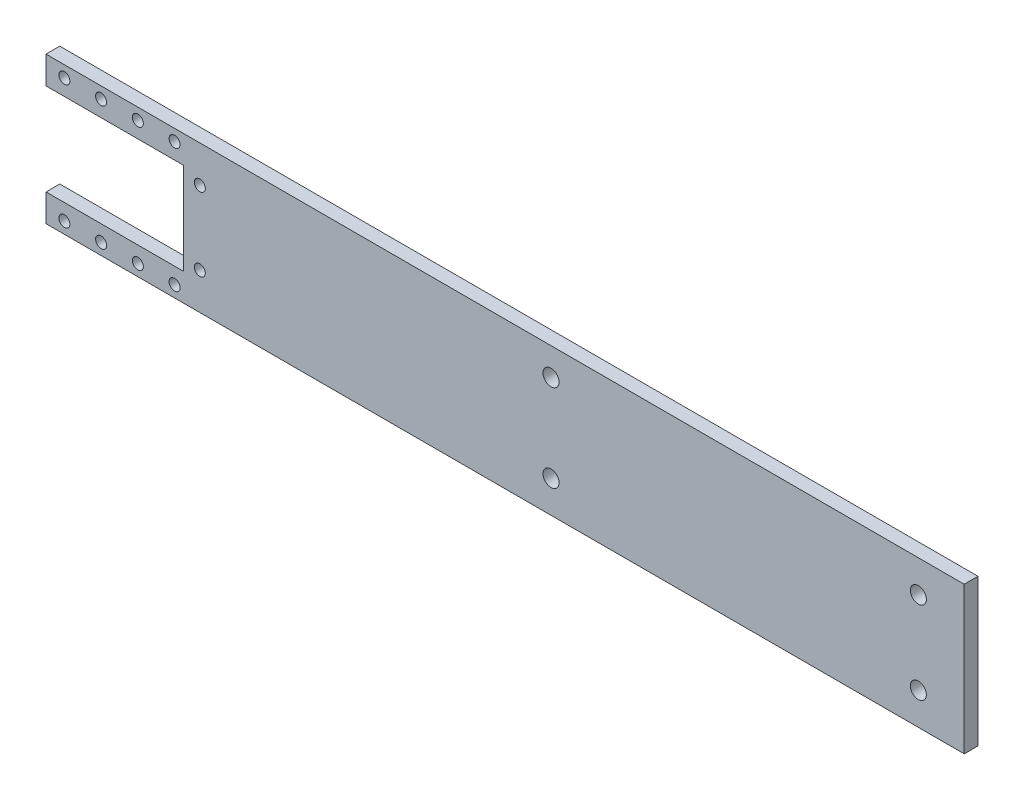
ISO-10303-21;
HEADER;
FILE_DESCRIPTION(('STEP AP214'),'2;1');
FILE_NAME('part.step','',(''),(''),'','','');
FILE_SCHEMA(('AUTOMOTIVE_DESIGN { 1 0 10303 214 1 1 1 1 }'));
ENDSEC;
DATA;
#1=APPLICATION_CONTEXT('core data for automotive mechanical design processes');
#2=APPLICATION_PROTOCOL_DEFINITION('international standard','automotive_design',2000,#1);
#3=PRODUCT_CONTEXT('',#1,'mechanical');
#4=PRODUCT('Part','Part','',(#3));
#5=PRODUCT_RELATED_PRODUCT_CATEGORY('part','',(#4));
#6=PRODUCT_DEFINITION_FORMATION('','',#4);
#7=PRODUCT_DEFINITION_CONTEXT('part definition',#1,'design');
#8=PRODUCT_DEFINITION('design','',#6,#7);
#9=PRODUCT_DEFINITION_SHAPE('','',#8);
#10=(LENGTH_UNIT() NAMED_UNIT(*) SI_UNIT(.MILLI.,.METRE.));
#11=(NAMED_UNIT(*) PLANE_ANGLE_UNIT() SI_UNIT($,.RADIAN.));
#12=(NAMED_UNIT(*) SI_UNIT($,.STERADIAN.) SOLID_ANGLE_UNIT());
#13=UNCERTAINTY_MEASURE_WITH_UNIT(LENGTH_MEASURE(1.E-05),#10,'distance_accuracy_value','');
#14=(GEOMETRIC_REPRESENTATION_CONTEXT(3) GLOBAL_UNCERTAINTY_ASSIGNED_CONTEXT((#13)) GLOBAL_UNIT_ASSIGNED_CONTEXT((#10,
#11,#12)) REPRESENTATION_CONTEXT('',''));
#15=CARTESIAN_POINT('',(0.,0.,0.));
#16=DIRECTION('',(0.,0.,1.));
#17=DIRECTION('',(1.,0.,0.));
#18=AXIS2_PLACEMENT_3D('',#15,#16,#17);
#19=CARTESIAN_POINT('',(-17.75,10.,3.));
#20=DIRECTION('',(-1.,0.,0.));
#21=DIRECTION('',(0.,-1.,0.));
#22=AXIS2_PLACEMENT_3D('',#19,#20,#21);
#23=PLANE('',#22);
#24=DIRECTION('',(0.,1.,0.));
#25=VECTOR('',#24,1.);
#26=CARTESIAN_POINT('',(-17.75,10.,0.));
#27=LINE('',#26,#25);
#28=CARTESIAN_POINT('',(-17.75,10.,0.));
#29=VERTEX_POINT('',#28);
#30=CARTESIAN_POINT('',(-17.75,16.,0.));
#31=VERTEX_POINT('',#30);
#32=EDGE_CURVE('E136',#29,#31,#27,.T.);
#33=ORIENTED_EDGE('',*,*,#32,.F.);
#34=DIRECTION('',(0.,0.,-1.));
#35=VECTOR('',#34,1.);
#36=CARTESIAN_POINT('',(-17.75,10.,3.));
#37=LINE('',#36,#35);
#38=CARTESIAN_POINT('',(-17.75,10.,3.));
#39=VERTEX_POINT('',#38);
#40=EDGE_CURVE('E11',#39,#29,#37,.T.);
#41=ORIENTED_EDGE('',*,*,#40,.F.);
#42=DIRECTION('',(0.,1.,0.));
#43=VECTOR('',#42,1.);
#44=CARTESIAN_POINT('',(-17.75,10.,3.));
#45=LINE('',#44,#43);
#46=CARTESIAN_POINT('',(-17.75,16.,3.));
#47=VERTEX_POINT('',#46);
#48=EDGE_CURVE('E155',#39,#47,#45,.T.);
#49=ORIENTED_EDGE('',*,*,#48,.T.);
#50=DIRECTION('',(0.,0.,-1.));
#51=VECTOR('',#50,1.);
#52=CARTESIAN_POINT('',(-17.75,16.,3.));
#53=LINE('',#52,#51);
#54=EDGE_CURVE('E40',#47,#31,#53,.T.);
#55=ORIENTED_EDGE('',*,*,#54,.T.);
#56=EDGE_LOOP('',(#33,#41,#49,#55));
#57=FACE_BOUND('',#56,.T.);
#58=ADVANCED_FACE('F37',(#57),#23,.T.);
#59=CARTESIAN_POINT('',(-17.75,10.,3.));
#60=DIRECTION('',(0.,1.,0.));
#61=DIRECTION('',(-1.,0.,0.));
#62=AXIS2_PLACEMENT_3D('',#59,#60,#61);
#63=PLANE('',#62);
#64=DIRECTION('',(1.,0.,0.));
#65=VECTOR('',#64,1.);
#66=CARTESIAN_POINT('',(-17.75,10.,0.));
#67=LINE('',#66,#65);
#68=CARTESIAN_POINT('',(12.25,10.,0.));
#69=VERTEX_POINT('',#68);
#70=EDGE_CURVE('E82',#29,#69,#67,.T.);
#71=ORIENTED_EDGE('',*,*,#70,.T.);
#72=DIRECTION('',(0.,0.,-1.));
#73=VECTOR('',#72,1.);
#74=CARTESIAN_POINT('',(12.25,10.,3.));
#75=LINE('',#74,#73);
#76=CARTESIAN_POINT('',(12.25,10.,3.));
#77=VERTEX_POINT('',#76);
#78=EDGE_CURVE('E46',#77,#69,#75,.T.);
#79=ORIENTED_EDGE('',*,*,#78,.F.);
#80=DIRECTION('',(1.,0.,0.));
#81=VECTOR('',#80,1.);
#82=CARTESIAN_POINT('',(-17.75,10.,3.));
#83=LINE('',#82,#81);
#84=EDGE_CURVE('E115',#39,#77,#83,.T.);
#85=ORIENTED_EDGE('',*,*,#84,.F.);
#86=ORIENTED_EDGE('',*,*,#40,.T.);
#87=EDGE_LOOP('',(#71,#79,#85,#86));
#88=FACE_BOUND('',#87,.T.);
#89=ADVANCED_FACE('F314',(#88),#63,.F.);
#90=CARTESIAN_POINT('',(12.25,10.,3.));
#91=DIRECTION('',(1.,0.,0.));
#92=DIRECTION('',(0.,0.,-1.));
#93=AXIS2_PLACEMENT_3D('',#90,#91,#92);
#94=PLANE('',#93);
#95=DIRECTION('',(0.,-1.,0.));
#96=VECTOR('',#95,1.);
#97=CARTESIAN_POINT('',(12.25,10.,0.));
#98=LINE('',#97,#96);
#99=CARTESIAN_POINT('',(12.25,-10.,0.));
#100=VERTEX_POINT('',#99);
#101=EDGE_CURVE('E122',#69,#100,#98,.T.);
#102=ORIENTED_EDGE('',*,*,#101,.T.);
#103=DIRECTION('',(0.,0.,-1.));
#104=VECTOR('',#103,1.);
#105=CARTESIAN_POINT('',(12.25,-10.,3.));
#106=LINE('',#105,#104);
#107=CARTESIAN_POINT('',(12.25,-10.,3.));
#108=VERTEX_POINT('',#107);
#109=EDGE_CURVE('E119',#108,#100,#106,.T.);
#110=ORIENTED_EDGE('',*,*,#109,.F.);
#111=DIRECTION('',(0.,-1.,0.));
#112=VECTOR('',#111,1.);
#113=CARTESIAN_POINT('',(12.25,10.,3.));
#114=LINE('',#113,#112);
#115=EDGE_CURVE('E107',#77,#108,#114,.T.);
#116=ORIENTED_EDGE('',*,*,#115,.F.);
#117=ORIENTED_EDGE('',*,*,#78,.T.);
#118=EDGE_LOOP('',(#102,#110,#116,#117));
#119=FACE_BOUND('',#118,.T.);
#120=ADVANCED_FACE('F120',(#119),#94,.F.);
#121=CARTESIAN_POINT('',(-17.75,-10.,3.));
#122=DIRECTION('',(0.,1.,0.));
#123=DIRECTION('',(0.,0.,1.));
#124=AXIS2_PLACEMENT_3D('',#121,#122,#123);
#125=PLANE('',#124);
#126=DIRECTION('',(1.,0.,0.));
#127=VECTOR('',#126,1.);
#128=CARTESIAN_POINT('',(-17.75,-10.,0.));
#129=LINE('',#128,#127);
#130=CARTESIAN_POINT('',(-17.75,-10.,0.));
#131=VERTEX_POINT('',#130);
#132=EDGE_CURVE('E152',#131,#100,#129,.T.);
#133=ORIENTED_EDGE('',*,*,#132,.F.);
#134=DIRECTION('',(0.,0.,-1.));
#135=VECTOR('',#134,1.);
#136=CARTESIAN_POINT('',(-17.75,-10.,3.));
#137=LINE('',#136,#135);
#138=CARTESIAN_POINT('',(-17.75,-10.,3.));
#139=VERTEX_POINT('',#138);
#140=EDGE_CURVE('E126',#139,#131,#137,.T.);
#141=ORIENTED_EDGE('',*,*,#140,.F.);
#142=DIRECTION('',(1.,0.,0.));
#143=VECTOR('',#142,1.);
#144=CARTESIAN_POINT('',(-17.75,-10.,3.));
#145=LINE('',#144,#143);
#146=EDGE_CURVE('E113',#139,#108,#145,.T.);
#147=ORIENTED_EDGE('',*,*,#146,.T.);
#148=ORIENTED_EDGE('',*,*,#109,.T.);
#149=EDGE_LOOP('',(#133,#141,#147,#148));
#150=FACE_BOUND('',#149,.T.);
#151=ADVANCED_FACE('F128',(#150),#125,.T.);
#152=CARTESIAN_POINT('',(-17.75,-16.,3.));
#153=DIRECTION('',(-1.,0.,0.));
#154=DIRECTION('',(0.,0.,1.));
#155=AXIS2_PLACEMENT_3D('',#152,#153,#154);
#156=PLANE('',#155);
#157=DIRECTION('',(0.,1.,0.));
#158=VECTOR('',#157,1.);
#159=CARTESIAN_POINT('',(-17.75,-16.,0.));
#160=LINE('',#159,#158);
#161=CARTESIAN_POINT('',(-17.75,-16.,0.));
#162=VERTEX_POINT('',#161);
#163=EDGE_CURVE('E149',#162,#131,#160,.T.);
#164=ORIENTED_EDGE('',*,*,#163,.F.);
#165=DIRECTION('',(0.,0.,-1.));
#166=VECTOR('',#165,1.);
#167=CARTESIAN_POINT('',(-17.75,-16.,3.));
#168=LINE('',#167,#166);
#169=CARTESIAN_POINT('',(-17.75,-16.,3.));
#170=VERTEX_POINT('',#169);
#171=EDGE_CURVE('E159',#170,#162,#168,.T.);
#172=ORIENTED_EDGE('',*,*,#171,.F.);
#173=DIRECTION('',(0.,1.,0.));
#174=VECTOR('',#173,1.);
#175=CARTESIAN_POINT('',(-17.75,-16.,3.));
#176=LINE('',#175,#174);
#177=EDGE_CURVE('E129',#170,#139,#176,.T.);
#178=ORIENTED_EDGE('',*,*,#177,.T.);
#179=ORIENTED_EDGE('',*,*,#140,.T.);
#180=EDGE_LOOP('',(#164,#172,#178,#179));
#181=FACE_BOUND('',#180,.T.);
#182=ADVANCED_FACE('F170',(#181),#156,.T.);
#183=CARTESIAN_POINT('',(182.25,-16.,3.));
#184=DIRECTION('',(0.,-1.,0.));
#185=DIRECTION('',(1.,0.,0.));
#186=AXIS2_PLACEMENT_3D('',#183,#184,#185);
#187=PLANE('',#186);
#188=DIRECTION('',(-1.,0.,0.));
#189=VECTOR('',#188,1.);
#190=CARTESIAN_POINT('',(182.25,-16.,0.));
#191=LINE('',#190,#189);
#192=CARTESIAN_POINT('',(182.25,-16.,0.));
#193=VERTEX_POINT('',#192);
#194=EDGE_CURVE('E146',#193,#162,#191,.T.);
#195=ORIENTED_EDGE('',*,*,#194,.F.);
#196=DIRECTION('',(0.,0.,-1.));
#197=VECTOR('',#196,1.);
#198=CARTESIAN_POINT('',(182.25,-16.,3.));
#199=LINE('',#198,#197);
#200=CARTESIAN_POINT('',(182.25,-16.,3.));
#201=VERTEX_POINT('',#200);
#202=EDGE_CURVE('E161',#201,#193,#199,.T.);
#203=ORIENTED_EDGE('',*,*,#202,.F.);
#204=DIRECTION('',(-1.,0.,0.));
#205=VECTOR('',#204,1.);
#206=CARTESIAN_POINT('',(182.25,-16.,3.));
#207=LINE('',#206,#205);
#208=EDGE_CURVE('E131',#201,#170,#207,.T.);
#209=ORIENTED_EDGE('',*,*,#208,.T.);
#210=ORIENTED_EDGE('',*,*,#171,.T.);
#211=EDGE_LOOP('',(#195,#203,#209,#210));
#212=FACE_BOUND('',#211,.T.);
#213=ADVANCED_FACE('F176',(#212),#187,.T.);
#214=CARTESIAN_POINT('',(182.25,16.,3.));
#215=DIRECTION('',(1.,0.,0.));
#216=DIRECTION('',(0.,0.,-1.));
#217=AXIS2_PLACEMENT_3D('',#214,#215,#216);
#218=PLANE('',#217);
#219=DIRECTION('',(0.,-1.,0.));
#220=VECTOR('',#219,1.);
#221=CARTESIAN_POINT('',(182.25,16.,0.));
#222=LINE('',#221,#220);
#223=CARTESIAN_POINT('',(182.25,16.,0.));
#224=VERTEX_POINT('',#223);
#225=EDGE_CURVE('E143',#224,#193,#222,.T.);
#226=ORIENTED_EDGE('',*,*,#225,.F.);
#227=DIRECTION('',(0.,0.,-1.));
#228=VECTOR('',#227,1.);
#229=CARTESIAN_POINT('',(182.25,16.,3.));
#230=LINE('',#229,#228);
#231=CARTESIAN_POINT('',(182.25,16.,3.));
#232=VERTEX_POINT('',#231);
#233=EDGE_CURVE('E162',#232,#224,#230,.T.);
#234=ORIENTED_EDGE('',*,*,#233,.F.);
#235=DIRECTION('',(0.,-1.,0.));
#236=VECTOR('',#235,1.);
#237=CARTESIAN_POINT('',(182.25,16.,3.));
#238=LINE('',#237,#236);
#239=EDGE_CURVE('E177',#232,#201,#238,.T.);
#240=ORIENTED_EDGE('',*,*,#239,.T.);
#241=ORIENTED_EDGE('',*,*,#202,.T.);
#242=EDGE_LOOP('',(#226,#234,#240,#241));
#243=FACE_BOUND('',#242,.T.);
#244=ADVANCED_FACE('F330',(#243),#218,.T.);
#245=CARTESIAN_POINT('',(-17.75,16.,3.));
#246=DIRECTION('',(0.,1.,0.));
#247=DIRECTION('',(0.,0.,1.));
#248=AXIS2_PLACEMENT_3D('',#245,#246,#247);
#249=PLANE('',#248);
#250=DIRECTION('',(1.,0.,0.));
#251=VECTOR('',#250,1.);
#252=CARTESIAN_POINT('',(-17.75,16.,0.));
#253=LINE('',#252,#251);
#254=EDGE_CURVE('E139',#31,#224,#253,.T.);
#255=ORIENTED_EDGE('',*,*,#254,.F.);
#256=ORIENTED_EDGE('',*,*,#54,.F.);
#257=DIRECTION('',(1.,0.,0.));
#258=VECTOR('',#257,1.);
#259=CARTESIAN_POINT('',(-17.75,16.,3.));
#260=LINE('',#259,#258);
#261=EDGE_CURVE('E178',#47,#232,#260,.T.);
#262=ORIENTED_EDGE('',*,*,#261,.T.);
#263=ORIENTED_EDGE('',*,*,#233,.T.);
#264=EDGE_LOOP('',(#255,#256,#262,#263));
#265=FACE_BOUND('',#264,.T.);
#266=ADVANCED_FACE('F164',(#265),#249,.T.);
#267=CARTESIAN_POINT('',(0.,0.,3.));
#268=DIRECTION('',(0.,0.,-1.));
#269=DIRECTION('',(-1.,0.,0.));
#270=AXIS2_PLACEMENT_3D('',#267,#268,#269);
#271=PLANE('',#270);
#272=CARTESIAN_POINT('',(92.25,-8.99999999999998,3.));
#273=DIRECTION('',(0.,0.,1.));
#274=DIRECTION('',(1.,0.,0.));
#275=AXIS2_PLACEMENT_3D('',#272,#273,#274);
#276=CIRCLE('',#275,1.75);
#277=CARTESIAN_POINT('',(94.,-8.99999999999998,3.));
#278=VERTEX_POINT('',#277);
#279=EDGE_CURVE('E263',#278,#278,#276,.T.);
#280=ORIENTED_EDGE('',*,*,#279,.F.);
#281=EDGE_LOOP('',(#280));
#282=FACE_BOUND('',#281,.T.);
#283=CARTESIAN_POINT('',(92.25,10.,3.));
#284=DIRECTION('',(0.,0.,1.));
#285=DIRECTION('',(1.,0.,0.));
#286=AXIS2_PLACEMENT_3D('',#283,#284,#285);
#287=CIRCLE('',#286,1.75);
#288=CARTESIAN_POINT('',(94.,10.,3.));
#289=VERTEX_POINT('',#288);
#290=EDGE_CURVE('E257',#289,#289,#287,.T.);
#291=ORIENTED_EDGE('',*,*,#290,.F.);
#292=EDGE_LOOP('',(#291));
#293=FACE_BOUND('',#292,.T.);
#294=CARTESIAN_POINT('',(172.25,9.,3.));
#295=DIRECTION('',(0.,0.,1.));
#296=DIRECTION('',(1.,0.,0.));
#297=AXIS2_PLACEMENT_3D('',#294,#295,#296);
#298=CIRCLE('',#297,1.75);
#299=CARTESIAN_POINT('',(174.,9.,3.));
#300=VERTEX_POINT('',#299);
#301=EDGE_CURVE('E251',#300,#300,#298,.T.);
#302=ORIENTED_EDGE('',*,*,#301,.F.);
#303=EDGE_LOOP('',(#302));
#304=FACE_BOUND('',#303,.T.);
#305=CARTESIAN_POINT('',(172.25,-8.99999999999998,3.));
#306=DIRECTION('',(0.,0.,1.));
#307=DIRECTION('',(1.,0.,0.));
#308=AXIS2_PLACEMENT_3D('',#305,#306,#307);
#309=CIRCLE('',#308,1.75);
#310=CARTESIAN_POINT('',(174.,-8.99999999999998,3.));
#311=VERTEX_POINT('',#310);
#312=EDGE_CURVE('E245',#311,#311,#309,.T.);
#313=ORIENTED_EDGE('',*,*,#312,.F.);
#314=EDGE_LOOP('',(#313));
#315=FACE_BOUND('',#314,.T.);
#316=CARTESIAN_POINT('',(-13.75,13.5,3.));
#317=DIRECTION('',(0.,0.,1.));
#318=DIRECTION('',(1.,0.,0.));
#319=AXIS2_PLACEMENT_3D('',#316,#317,#318);
#320=CIRCLE('',#319,1.19999999999999);
#321=CARTESIAN_POINT('',(-12.55,13.5,3.));
#322=VERTEX_POINT('',#321);
#323=EDGE_CURVE('E239',#322,#322,#320,.T.);
#324=ORIENTED_EDGE('',*,*,#323,.F.);
#325=EDGE_LOOP('',(#324));
#326=FACE_BOUND('',#325,.T.);
#327=CARTESIAN_POINT('',(-5.75000000000001,13.5,3.));
#328=DIRECTION('',(0.,0.,1.));
#329=DIRECTION('',(1.,0.,0.));
#330=AXIS2_PLACEMENT_3D('',#327,#328,#329);
#331=CIRCLE('',#330,1.19999999999999);
#332=CARTESIAN_POINT('',(-4.55000000000002,13.5,3.));
#333=VERTEX_POINT('',#332);
#334=EDGE_CURVE('E233',#333,#333,#331,.T.);
#335=ORIENTED_EDGE('',*,*,#334,.F.);
#336=EDGE_LOOP('',(#335));
#337=FACE_BOUND('',#336,.T.);
#338=CARTESIAN_POINT('',(2.25,13.5,3.));
#339=DIRECTION('',(0.,0.,1.));
#340=DIRECTION('',(1.,0.,0.));
#341=AXIS2_PLACEMENT_3D('',#338,#339,#340);
#342=CIRCLE('',#341,1.19999999999999);
#343=CARTESIAN_POINT('',(3.44999999999999,13.5,3.));
#344=VERTEX_POINT('',#343);
#345=EDGE_CURVE('E227',#344,#344,#342,.T.);
#346=ORIENTED_EDGE('',*,*,#345,.F.);
#347=EDGE_LOOP('',(#346));
#348=FACE_BOUND('',#347,.T.);
#349=CARTESIAN_POINT('',(10.25,13.5,3.));
#350=DIRECTION('',(0.,0.,1.));
#351=DIRECTION('',(1.,0.,0.));
#352=AXIS2_PLACEMENT_3D('',#349,#350,#351);
#353=CIRCLE('',#352,1.19999999999999);
#354=CARTESIAN_POINT('',(11.45,13.5,3.));
#355=VERTEX_POINT('',#354);
#356=EDGE_CURVE('E221',#355,#355,#353,.T.);
#357=ORIENTED_EDGE('',*,*,#356,.F.);
#358=EDGE_LOOP('',(#357));
#359=FACE_BOUND('',#358,.T.);
#360=CARTESIAN_POINT('',(15.75,8.,3.));
#361=DIRECTION('',(0.,0.,1.));
#362=DIRECTION('',(1.,0.,0.));
#363=AXIS2_PLACEMENT_3D('',#360,#361,#362);
#364=CIRCLE('',#363,1.19999999999999);
#365=CARTESIAN_POINT('',(16.95,8.,3.));
#366=VERTEX_POINT('',#365);
#367=EDGE_CURVE('E215',#366,#366,#364,.T.);
#368=ORIENTED_EDGE('',*,*,#367,.F.);
#369=EDGE_LOOP('',(#368));
#370=FACE_BOUND('',#369,.T.);
#371=CARTESIAN_POINT('',(15.75,-8.,3.));
#372=DIRECTION('',(0.,0.,1.));
#373=DIRECTION('',(1.,0.,0.));
#374=AXIS2_PLACEMENT_3D('',#371,#372,#373);
#375=CIRCLE('',#374,1.19999999999999);
#376=CARTESIAN_POINT('',(16.95,-8.,3.));
#377=VERTEX_POINT('',#376);
#378=EDGE_CURVE('E209',#377,#377,#375,.T.);
#379=ORIENTED_EDGE('',*,*,#378,.F.);
#380=EDGE_LOOP('',(#379));
#381=FACE_BOUND('',#380,.T.);
#382=CARTESIAN_POINT('',(10.25,-13.5,3.));
#383=DIRECTION('',(0.,0.,1.));
#384=DIRECTION('',(1.,0.,0.));
#385=AXIS2_PLACEMENT_3D('',#382,#383,#384);
#386=CIRCLE('',#385,1.19999999999999);
#387=CARTESIAN_POINT('',(11.45,-13.5,3.));
#388=VERTEX_POINT('',#387);
#389=EDGE_CURVE('E203',#388,#388,#386,.T.);
#390=ORIENTED_EDGE('',*,*,#389,.F.);
#391=EDGE_LOOP('',(#390));
#392=FACE_BOUND('',#391,.T.);
#393=CARTESIAN_POINT('',(2.25,-13.5,3.));
#394=DIRECTION('',(0.,0.,1.));
#395=DIRECTION('',(1.,0.,0.));
#396=AXIS2_PLACEMENT_3D('',#393,#394,#395);
#397=CIRCLE('',#396,1.19999999999999);
#398=CARTESIAN_POINT('',(3.44999999999999,-13.5,3.));
#399=VERTEX_POINT('',#398);
#400=EDGE_CURVE('E197',#399,#399,#397,.T.);
#401=ORIENTED_EDGE('',*,*,#400,.F.);
#402=EDGE_LOOP('',(#401));
#403=FACE_BOUND('',#402,.T.);
#404=CARTESIAN_POINT('',(-5.75000000000001,-13.5,3.));
#405=DIRECTION('',(0.,0.,1.));
#406=DIRECTION('',(1.,0.,0.));
#407=AXIS2_PLACEMENT_3D('',#404,#405,#406);
#408=CIRCLE('',#407,1.19999999999999);
#409=CARTESIAN_POINT('',(-4.55000000000002,-13.5,3.));
#410=VERTEX_POINT('',#409);
#411=EDGE_CURVE('E191',#410,#410,#408,.T.);
#412=ORIENTED_EDGE('',*,*,#411,.F.);
#413=EDGE_LOOP('',(#412));
#414=FACE_BOUND('',#413,.T.);
#415=CARTESIAN_POINT('',(-13.75,-13.5,3.));
#416=DIRECTION('',(0.,0.,1.));
#417=DIRECTION('',(1.,0.,0.));
#418=AXIS2_PLACEMENT_3D('',#415,#416,#417);
#419=CIRCLE('',#418,1.19999999999999);
#420=CARTESIAN_POINT('',(-12.55,-13.5,3.));
#421=VERTEX_POINT('',#420);
#422=EDGE_CURVE('E185',#421,#421,#419,.T.);
#423=ORIENTED_EDGE('',*,*,#422,.F.);
#424=EDGE_LOOP('',(#423));
#425=FACE_BOUND('',#424,.T.);
#426=ORIENTED_EDGE('',*,*,#48,.F.);
#427=ORIENTED_EDGE('',*,*,#84,.T.);
#428=ORIENTED_EDGE('',*,*,#115,.T.);
#429=ORIENTED_EDGE('',*,*,#146,.F.);
#430=ORIENTED_EDGE('',*,*,#177,.F.);
#431=ORIENTED_EDGE('',*,*,#208,.F.);
#432=ORIENTED_EDGE('',*,*,#239,.F.);
#433=ORIENTED_EDGE('',*,*,#261,.F.);
#434=EDGE_LOOP('',(#426,#427,#428,#429,#430,#431,#432,#433));
#435=FACE_BOUND('',#434,.T.);
#436=ADVANCED_FACE('F110',(#282,#293,#304,#315,#326,#337,#348,#359,#370,#381,#392,#403,#414,
#425,#435),#271,.F.);
#437=CARTESIAN_POINT('',(0.,0.,0.));
#438=DIRECTION('',(0.,0.,-1.));
#439=DIRECTION('',(-1.,0.,0.));
#440=AXIS2_PLACEMENT_3D('',#437,#438,#439);
#441=PLANE('',#440);
#442=CARTESIAN_POINT('',(92.25,-8.99999999999998,0.));
#443=DIRECTION('',(0.,0.,1.));
#444=DIRECTION('',(1.,0.,0.));
#445=AXIS2_PLACEMENT_3D('',#442,#443,#444);
#446=CIRCLE('',#445,1.75);
#447=CARTESIAN_POINT('',(94.,-8.99999999999998,0.));
#448=VERTEX_POINT('',#447);
#449=EDGE_CURVE('E260',#448,#448,#446,.T.);
#450=ORIENTED_EDGE('',*,*,#449,.T.);
#451=EDGE_LOOP('',(#450));
#452=FACE_BOUND('',#451,.T.);
#453=CARTESIAN_POINT('',(92.25,10.,0.));
#454=DIRECTION('',(0.,0.,1.));
#455=DIRECTION('',(1.,0.,0.));
#456=AXIS2_PLACEMENT_3D('',#453,#454,#455);
#457=CIRCLE('',#456,1.75);
#458=CARTESIAN_POINT('',(94.,10.,0.));
#459=VERTEX_POINT('',#458);
#460=EDGE_CURVE('E254',#459,#459,#457,.T.);
#461=ORIENTED_EDGE('',*,*,#460,.T.);
#462=EDGE_LOOP('',(#461));
#463=FACE_BOUND('',#462,.T.);
#464=CARTESIAN_POINT('',(172.25,9.,0.));
#465=DIRECTION('',(0.,0.,1.));
#466=DIRECTION('',(1.,0.,0.));
#467=AXIS2_PLACEMENT_3D('',#464,#465,#466);
#468=CIRCLE('',#467,1.75);
#469=CARTESIAN_POINT('',(174.,9.,0.));
#470=VERTEX_POINT('',#469);
#471=EDGE_CURVE('E248',#470,#470,#468,.T.);
#472=ORIENTED_EDGE('',*,*,#471,.T.);
#473=EDGE_LOOP('',(#472));
#474=FACE_BOUND('',#473,.T.);
#475=CARTESIAN_POINT('',(172.25,-8.99999999999998,0.));
#476=DIRECTION('',(0.,0.,1.));
#477=DIRECTION('',(1.,0.,0.));
#478=AXIS2_PLACEMENT_3D('',#475,#476,#477);
#479=CIRCLE('',#478,1.75);
#480=CARTESIAN_POINT('',(174.,-8.99999999999998,0.));
#481=VERTEX_POINT('',#480);
#482=EDGE_CURVE('E242',#481,#481,#479,.T.);
#483=ORIENTED_EDGE('',*,*,#482,.T.);
#484=EDGE_LOOP('',(#483));
#485=FACE_BOUND('',#484,.T.);
#486=CARTESIAN_POINT('',(-13.75,13.5,0.));
#487=DIRECTION('',(0.,0.,1.));
#488=DIRECTION('',(1.,0.,0.));
#489=AXIS2_PLACEMENT_3D('',#486,#487,#488);
#490=CIRCLE('',#489,1.2);
#491=CARTESIAN_POINT('',(-12.55,13.5,0.));
#492=VERTEX_POINT('',#491);
#493=EDGE_CURVE('E236',#492,#492,#490,.T.);
#494=ORIENTED_EDGE('',*,*,#493,.T.);
#495=EDGE_LOOP('',(#494));
#496=FACE_BOUND('',#495,.T.);
#497=CARTESIAN_POINT('',(-5.75000000000001,13.5,0.));
#498=DIRECTION('',(0.,0.,1.));
#499=DIRECTION('',(1.,0.,0.));
#500=AXIS2_PLACEMENT_3D('',#497,#498,#499);
#501=CIRCLE('',#500,1.2);
#502=CARTESIAN_POINT('',(-4.55000000000001,13.5,0.));
#503=VERTEX_POINT('',#502);
#504=EDGE_CURVE('E230',#503,#503,#501,.T.);
#505=ORIENTED_EDGE('',*,*,#504,.T.);
#506=EDGE_LOOP('',(#505));
#507=FACE_BOUND('',#506,.T.);
#508=CARTESIAN_POINT('',(2.25,13.5,0.));
#509=DIRECTION('',(0.,0.,1.));
#510=DIRECTION('',(1.,0.,0.));
#511=AXIS2_PLACEMENT_3D('',#508,#509,#510);
#512=CIRCLE('',#511,1.2);
#513=CARTESIAN_POINT('',(3.45,13.5,0.));
#514=VERTEX_POINT('',#513);
#515=EDGE_CURVE('E224',#514,#514,#512,.T.);
#516=ORIENTED_EDGE('',*,*,#515,.T.);
#517=EDGE_LOOP('',(#516));
#518=FACE_BOUND('',#517,.T.);
#519=CARTESIAN_POINT('',(10.25,13.5,0.));
#520=DIRECTION('',(0.,0.,1.));
#521=DIRECTION('',(1.,0.,0.));
#522=AXIS2_PLACEMENT_3D('',#519,#520,#521);
#523=CIRCLE('',#522,1.2);
#524=CARTESIAN_POINT('',(11.45,13.5,0.));
#525=VERTEX_POINT('',#524);
#526=EDGE_CURVE('E218',#525,#525,#523,.T.);
#527=ORIENTED_EDGE('',*,*,#526,.T.);
#528=EDGE_LOOP('',(#527));
#529=FACE_BOUND('',#528,.T.);
#530=CARTESIAN_POINT('',(15.75,8.,0.));
#531=DIRECTION('',(0.,0.,1.));
#532=DIRECTION('',(1.,0.,0.));
#533=AXIS2_PLACEMENT_3D('',#530,#531,#532);
#534=CIRCLE('',#533,1.2);
#535=CARTESIAN_POINT('',(16.95,8.,0.));
#536=VERTEX_POINT('',#535);
#537=EDGE_CURVE('E212',#536,#536,#534,.T.);
#538=ORIENTED_EDGE('',*,*,#537,.T.);
#539=EDGE_LOOP('',(#538));
#540=FACE_BOUND('',#539,.T.);
#541=CARTESIAN_POINT('',(15.75,-8.,0.));
#542=DIRECTION('',(0.,0.,1.));
#543=DIRECTION('',(1.,0.,0.));
#544=AXIS2_PLACEMENT_3D('',#541,#542,#543);
#545=CIRCLE('',#544,1.2);
#546=CARTESIAN_POINT('',(16.95,-8.,0.));
#547=VERTEX_POINT('',#546);
#548=EDGE_CURVE('E206',#547,#547,#545,.T.);
#549=ORIENTED_EDGE('',*,*,#548,.T.);
#550=EDGE_LOOP('',(#549));
#551=FACE_BOUND('',#550,.T.);
#552=CARTESIAN_POINT('',(10.25,-13.5,0.));
#553=DIRECTION('',(0.,0.,1.));
#554=DIRECTION('',(1.,0.,0.));
#555=AXIS2_PLACEMENT_3D('',#552,#553,#554);
#556=CIRCLE('',#555,1.2);
#557=CARTESIAN_POINT('',(11.45,-13.5,0.));
#558=VERTEX_POINT('',#557);
#559=EDGE_CURVE('E200',#558,#558,#556,.T.);
#560=ORIENTED_EDGE('',*,*,#559,.T.);
#561=EDGE_LOOP('',(#560));
#562=FACE_BOUND('',#561,.T.);
#563=CARTESIAN_POINT('',(2.25,-13.5,0.));
#564=DIRECTION('',(0.,0.,1.));
#565=DIRECTION('',(1.,0.,0.));
#566=AXIS2_PLACEMENT_3D('',#563,#564,#565);
#567=CIRCLE('',#566,1.2);
#568=CARTESIAN_POINT('',(3.45,-13.5,0.));
#569=VERTEX_POINT('',#568);
#570=EDGE_CURVE('E194',#569,#569,#567,.T.);
#571=ORIENTED_EDGE('',*,*,#570,.T.);
#572=EDGE_LOOP('',(#571));
#573=FACE_BOUND('',#572,.T.);
#574=CARTESIAN_POINT('',(-5.75000000000001,-13.5,0.));
#575=DIRECTION('',(0.,0.,1.));
#576=DIRECTION('',(1.,0.,0.));
#577=AXIS2_PLACEMENT_3D('',#574,#575,#576);
#578=CIRCLE('',#577,1.2);
#579=CARTESIAN_POINT('',(-4.55000000000001,-13.5,0.));
#580=VERTEX_POINT('',#579);
#581=EDGE_CURVE('E188',#580,#580,#578,.T.);
#582=ORIENTED_EDGE('',*,*,#581,.T.);
#583=EDGE_LOOP('',(#582));
#584=FACE_BOUND('',#583,.T.);
#585=CARTESIAN_POINT('',(-13.75,-13.5,0.));
#586=DIRECTION('',(0.,0.,1.));
#587=DIRECTION('',(1.,0.,0.));
#588=AXIS2_PLACEMENT_3D('',#585,#586,#587);
#589=CIRCLE('',#588,1.2);
#590=CARTESIAN_POINT('',(-12.55,-13.5,0.));
#591=VERTEX_POINT('',#590);
#592=EDGE_CURVE('E140',#591,#591,#589,.T.);
#593=ORIENTED_EDGE('',*,*,#592,.T.);
#594=EDGE_LOOP('',(#593));
#595=FACE_BOUND('',#594,.T.);
#596=ORIENTED_EDGE('',*,*,#32,.T.);
#597=ORIENTED_EDGE('',*,*,#254,.T.);
#598=ORIENTED_EDGE('',*,*,#225,.T.);
#599=ORIENTED_EDGE('',*,*,#194,.T.);
#600=ORIENTED_EDGE('',*,*,#163,.T.);
#601=ORIENTED_EDGE('',*,*,#132,.T.);
#602=ORIENTED_EDGE('',*,*,#101,.F.);
#603=ORIENTED_EDGE('',*,*,#70,.F.);
#604=EDGE_LOOP('',(#596,#597,#598,#599,#600,#601,#602,#603));
#605=FACE_BOUND('',#604,.T.);
#606=ADVANCED_FACE('F166',(#452,#463,#474,#485,#496,#507,#518,#529,#540,#551,#562,#573,#584,
#595,#605),#441,.T.);
#607=CARTESIAN_POINT('',(-13.75,-13.5,3.));
#608=DIRECTION('',(0.,0.,1.));
#609=DIRECTION('',(1.,0.,0.));
#610=AXIS2_PLACEMENT_3D('',#607,#608,#609);
#611=CYLINDRICAL_SURFACE('',#610,1.19999999999999);
#612=ORIENTED_EDGE('',*,*,#592,.F.);
#613=EDGE_LOOP('',(#612));
#614=FACE_BOUND('',#613,.T.);
#615=ORIENTED_EDGE('',*,*,#422,.T.);
#616=EDGE_LOOP('',(#615));
#617=FACE_BOUND('',#616,.T.);
#618=ADVANCED_FACE('F298',(#614,#617),#611,.F.);
#619=CARTESIAN_POINT('',(-5.75000000000001,-13.5,3.));
#620=DIRECTION('',(0.,0.,1.));
#621=DIRECTION('',(1.,0.,0.));
#622=AXIS2_PLACEMENT_3D('',#619,#620,#621);
#623=CYLINDRICAL_SURFACE('',#622,1.19999999999999);
#624=ORIENTED_EDGE('',*,*,#581,.F.);
#625=EDGE_LOOP('',(#624));
#626=FACE_BOUND('',#625,.T.);
#627=ORIENTED_EDGE('',*,*,#411,.T.);
#628=EDGE_LOOP('',(#627));
#629=FACE_BOUND('',#628,.T.);
#630=ADVANCED_FACE('F300',(#626,#629),#623,.F.);
#631=CARTESIAN_POINT('',(2.25,-13.5,3.));
#632=DIRECTION('',(0.,0.,1.));
#633=DIRECTION('',(1.,0.,0.));
#634=AXIS2_PLACEMENT_3D('',#631,#632,#633);
#635=CYLINDRICAL_SURFACE('',#634,1.19999999999999);
#636=ORIENTED_EDGE('',*,*,#570,.F.);
#637=EDGE_LOOP('',(#636));
#638=FACE_BOUND('',#637,.T.);
#639=ORIENTED_EDGE('',*,*,#400,.T.);
#640=EDGE_LOOP('',(#639));
#641=FACE_BOUND('',#640,.T.);
#642=ADVANCED_FACE('F307',(#638,#641),#635,.F.);
#643=CARTESIAN_POINT('',(10.25,-13.5,3.));
#644=DIRECTION('',(0.,0.,1.));
#645=DIRECTION('',(1.,0.,0.));
#646=AXIS2_PLACEMENT_3D('',#643,#644,#645);
#647=CYLINDRICAL_SURFACE('',#646,1.19999999999999);
#648=ORIENTED_EDGE('',*,*,#559,.F.);
#649=EDGE_LOOP('',(#648));
#650=FACE_BOUND('',#649,.T.);
#651=ORIENTED_EDGE('',*,*,#389,.T.);
#652=EDGE_LOOP('',(#651));
#653=FACE_BOUND('',#652,.T.);
#654=ADVANCED_FACE('F417',(#650,#653),#647,.F.);
#655=CARTESIAN_POINT('',(15.75,-8.,3.));
#656=DIRECTION('',(0.,0.,1.));
#657=DIRECTION('',(1.,0.,0.));
#658=AXIS2_PLACEMENT_3D('',#655,#656,#657);
#659=CYLINDRICAL_SURFACE('',#658,1.19999999999999);
#660=ORIENTED_EDGE('',*,*,#548,.F.);
#661=EDGE_LOOP('',(#660));
#662=FACE_BOUND('',#661,.T.);
#663=ORIENTED_EDGE('',*,*,#378,.T.);
#664=EDGE_LOOP('',(#663));
#665=FACE_BOUND('',#664,.T.);
#666=ADVANCED_FACE('F413',(#662,#665),#659,.F.);
#667=CARTESIAN_POINT('',(15.75,8.,3.));
#668=DIRECTION('',(0.,0.,1.));
#669=DIRECTION('',(1.,0.,0.));
#670=AXIS2_PLACEMENT_3D('',#667,#668,#669);
#671=CYLINDRICAL_SURFACE('',#670,1.19999999999999);
#672=ORIENTED_EDGE('',*,*,#537,.F.);
#673=EDGE_LOOP('',(#672));
#674=FACE_BOUND('',#673,.T.);
#675=ORIENTED_EDGE('',*,*,#367,.T.);
#676=EDGE_LOOP('',(#675));
#677=FACE_BOUND('',#676,.T.);
#678=ADVANCED_FACE('F409',(#674,#677),#671,.F.);
#679=CARTESIAN_POINT('',(10.25,13.5,3.));
#680=DIRECTION('',(0.,0.,1.));
#681=DIRECTION('',(1.,0.,0.));
#682=AXIS2_PLACEMENT_3D('',#679,#680,#681);
#683=CYLINDRICAL_SURFACE('',#682,1.19999999999999);
#684=ORIENTED_EDGE('',*,*,#526,.F.);
#685=EDGE_LOOP('',(#684));
#686=FACE_BOUND('',#685,.T.);
#687=ORIENTED_EDGE('',*,*,#356,.T.);
#688=EDGE_LOOP('',(#687));
#689=FACE_BOUND('',#688,.T.);
#690=ADVANCED_FACE('F405',(#686,#689),#683,.F.);
#691=CARTESIAN_POINT('',(2.25,13.5,3.));
#692=DIRECTION('',(0.,0.,1.));
#693=DIRECTION('',(1.,0.,0.));
#694=AXIS2_PLACEMENT_3D('',#691,#692,#693);
#695=CYLINDRICAL_SURFACE('',#694,1.19999999999999);
#696=ORIENTED_EDGE('',*,*,#515,.F.);
#697=EDGE_LOOP('',(#696));
#698=FACE_BOUND('',#697,.T.);
#699=ORIENTED_EDGE('',*,*,#345,.T.);
#700=EDGE_LOOP('',(#699));
#701=FACE_BOUND('',#700,.T.);
#702=ADVANCED_FACE('F401',(#698,#701),#695,.F.);
#703=CARTESIAN_POINT('',(-5.75000000000001,13.5,3.));
#704=DIRECTION('',(0.,0.,1.));
#705=DIRECTION('',(1.,0.,0.));
#706=AXIS2_PLACEMENT_3D('',#703,#704,#705);
#707=CYLINDRICAL_SURFACE('',#706,1.19999999999999);
#708=ORIENTED_EDGE('',*,*,#504,.F.);
#709=EDGE_LOOP('',(#708));
#710=FACE_BOUND('',#709,.T.);
#711=ORIENTED_EDGE('',*,*,#334,.T.);
#712=EDGE_LOOP('',(#711));
#713=FACE_BOUND('',#712,.T.);
#714=ADVANCED_FACE('F397',(#710,#713),#707,.F.);
#715=CARTESIAN_POINT('',(-13.75,13.5,3.));
#716=DIRECTION('',(0.,0.,1.));
#717=DIRECTION('',(1.,0.,0.));
#718=AXIS2_PLACEMENT_3D('',#715,#716,#717);
#719=CYLINDRICAL_SURFACE('',#718,1.19999999999999);
#720=ORIENTED_EDGE('',*,*,#493,.F.);
#721=EDGE_LOOP('',(#720));
#722=FACE_BOUND('',#721,.T.);
#723=ORIENTED_EDGE('',*,*,#323,.T.);
#724=EDGE_LOOP('',(#723));
#725=FACE_BOUND('',#724,.T.);
#726=ADVANCED_FACE('F359',(#722,#725),#719,.F.);
#727=CARTESIAN_POINT('',(172.25,-8.99999999999998,3.));
#728=DIRECTION('',(0.,0.,1.));
#729=DIRECTION('',(1.,0.,0.));
#730=AXIS2_PLACEMENT_3D('',#727,#728,#729);
#731=CYLINDRICAL_SURFACE('',#730,1.75);
#732=ORIENTED_EDGE('',*,*,#482,.F.);
#733=EDGE_LOOP('',(#732));
#734=FACE_BOUND('',#733,.T.);
#735=ORIENTED_EDGE('',*,*,#312,.T.);
#736=EDGE_LOOP('',(#735));
#737=FACE_BOUND('',#736,.T.);
#738=ADVANCED_FACE('F353',(#734,#737),#731,.F.);
#739=CARTESIAN_POINT('',(172.25,9.,3.));
#740=DIRECTION('',(0.,0.,1.));
#741=DIRECTION('',(1.,0.,0.));
#742=AXIS2_PLACEMENT_3D('',#739,#740,#741);
#743=CYLINDRICAL_SURFACE('',#742,1.75);
#744=ORIENTED_EDGE('',*,*,#471,.F.);
#745=EDGE_LOOP('',(#744));
#746=FACE_BOUND('',#745,.T.);
#747=ORIENTED_EDGE('',*,*,#301,.T.);
#748=EDGE_LOOP('',(#747));
#749=FACE_BOUND('',#748,.T.);
#750=ADVANCED_FACE('F358',(#746,#749),#743,.F.);
#751=CARTESIAN_POINT('',(92.25,10.,3.));
#752=DIRECTION('',(0.,0.,1.));
#753=DIRECTION('',(1.,0.,0.));
#754=AXIS2_PLACEMENT_3D('',#751,#752,#753);
#755=CYLINDRICAL_SURFACE('',#754,1.75);
#756=ORIENTED_EDGE('',*,*,#460,.F.);
#757=EDGE_LOOP('',(#756));
#758=FACE_BOUND('',#757,.T.);
#759=ORIENTED_EDGE('',*,*,#290,.T.);
#760=EDGE_LOOP('',(#759));
#761=FACE_BOUND('',#760,.T.);
#762=ADVANCED_FACE('F371',(#758,#761),#755,.F.);
#763=CARTESIAN_POINT('',(92.25,-8.99999999999998,3.));
#764=DIRECTION('',(0.,0.,1.));
#765=DIRECTION('',(1.,0.,0.));
#766=AXIS2_PLACEMENT_3D('',#763,#764,#765);
#767=CYLINDRICAL_SURFACE('',#766,1.75);
#768=ORIENTED_EDGE('',*,*,#449,.F.);
#769=EDGE_LOOP('',(#768));
#770=FACE_BOUND('',#769,.T.);
#771=ORIENTED_EDGE('',*,*,#279,.T.);
#772=EDGE_LOOP('',(#771));
#773=FACE_BOUND('',#772,.T.);
#774=ADVANCED_FACE('F267',(#770,#773),#767,.F.);
#775=CLOSED_SHELL('',(#58,#89,#120,#151,#182,#213,#244,#266,#436,#606,#618,#630,#642,#654,#666,
#678,#690,#702,#714,#726,#738,#750,#762,#774));
#776=MANIFOLD_SOLID_BREP('B2',#775);
#777=ADVANCED_BREP_SHAPE_REPRESENTATION('',(#18,#776),#14);
#778=SHAPE_DEFINITION_REPRESENTATION(#9,#777);
ENDSEC;
END-ISO-10303-21;
